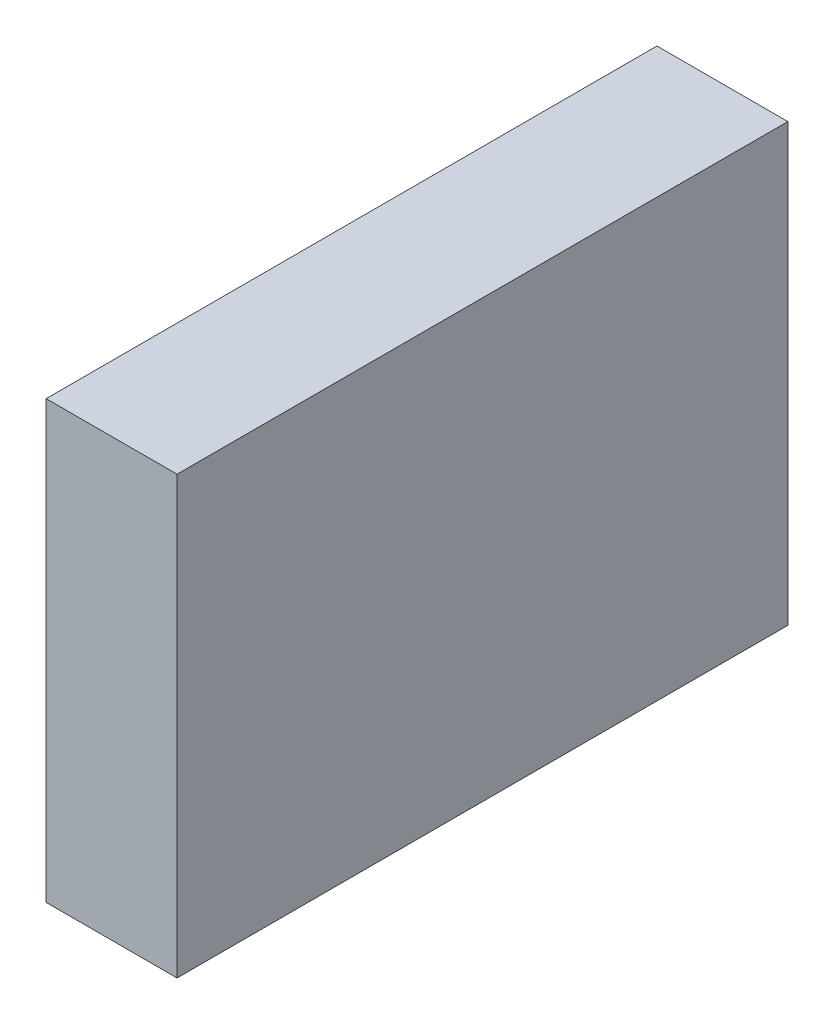
ISO-10303-21;
HEADER;
FILE_DESCRIPTION(('STEP AP214'),'2;1');
FILE_NAME('part.step','',(''),(''),'','','');
FILE_SCHEMA(('AUTOMOTIVE_DESIGN { 1 0 10303 214 1 1 1 1 }'));
ENDSEC;
DATA;
#1=APPLICATION_CONTEXT('core data for automotive mechanical design processes');
#2=APPLICATION_PROTOCOL_DEFINITION('international standard','automotive_design',2000,#1);
#3=PRODUCT_CONTEXT('',#1,'mechanical');
#4=PRODUCT('Part','Part','',(#3));
#5=PRODUCT_RELATED_PRODUCT_CATEGORY('part','',(#4));
#6=PRODUCT_DEFINITION_FORMATION('','',#4);
#7=PRODUCT_DEFINITION_CONTEXT('part definition',#1,'design');
#8=PRODUCT_DEFINITION('design','',#6,#7);
#9=PRODUCT_DEFINITION_SHAPE('','',#8);
#10=(LENGTH_UNIT() NAMED_UNIT(*) SI_UNIT(.MILLI.,.METRE.));
#11=(NAMED_UNIT(*) PLANE_ANGLE_UNIT() SI_UNIT($,.RADIAN.));
#12=(NAMED_UNIT(*) SI_UNIT($,.STERADIAN.) SOLID_ANGLE_UNIT());
#13=UNCERTAINTY_MEASURE_WITH_UNIT(LENGTH_MEASURE(1.E-05),#10,'distance_accuracy_value','');
#14=(GEOMETRIC_REPRESENTATION_CONTEXT(3) GLOBAL_UNCERTAINTY_ASSIGNED_CONTEXT((#13)) GLOBAL_UNIT_ASSIGNED_CONTEXT((#10,
#11,#12)) REPRESENTATION_CONTEXT('',''));
#15=CARTESIAN_POINT('',(0.,0.,0.));
#16=DIRECTION('',(0.,0.,1.));
#17=DIRECTION('',(1.,0.,0.));
#18=AXIS2_PLACEMENT_3D('',#15,#16,#17);
#19=CARTESIAN_POINT('',(2.99999968178111,-1.82000034706842,-3.72112136188662));
#20=DIRECTION('',(1.,-1.74845553146952E-07,0.));
#21=DIRECTION('',(1.74845553146952E-07,1.,-8.74227765734759E-08));
#22=AXIS2_PLACEMENT_3D('',#19,#20,#21);
#23=PLANE('',#22);
#24=DIRECTION('',(1.74845553146599E-07,0.999999999999981,-8.74227765732993E-08));
#25=VECTOR('',#24,1.);
#26=CARTESIAN_POINT('',(2.9999996940203,-1.75000034094883,-3.65112136800621));
#27=LINE('',#26,#25);
#28=CARTESIAN_POINT('',(2.9999996940203,-1.75000034094783,-3.65112136800621));
#29=VERTEX_POINT('',#28);
#30=CARTESIAN_POINT('',(2.99999986886585,-0.750000340946829,-3.65112145542799));
#31=VERTEX_POINT('',#30);
#32=EDGE_CURVE('E11',#29,#31,#27,.T.);
#33=ORIENTED_EDGE('',*,*,#32,.F.);
#34=DIRECTION('',(0.,-8.74227766369168E-08,-0.999999999999996));
#35=VECTOR('',#34,1.);
#36=CARTESIAN_POINT('',(2.99999969402031,-1.75000021855694,-2.25112136800621));
#37=LINE('',#36,#35);
#38=CARTESIAN_POINT('',(2.99999969402031,-1.75000021855694,-2.25112136800721));
#39=VERTEX_POINT('',#38);
#40=EDGE_CURVE('E59',#39,#29,#37,.T.);
#41=ORIENTED_EDGE('',*,*,#40,.F.);
#42=DIRECTION('',(-1.74845553146599E-07,-0.999999999999981,8.74227765732994E-08));
#43=VECTOR('',#42,1.);
#44=CARTESIAN_POINT('',(2.99999986886586,-0.750000218554941,-2.25112145542899));
#45=LINE('',#44,#43);
#46=CARTESIAN_POINT('',(2.99999986886586,-0.750000218555941,-2.25112145542899));
#47=VERTEX_POINT('',#46);
#48=EDGE_CURVE('E79',#47,#39,#45,.T.);
#49=ORIENTED_EDGE('',*,*,#48,.F.);
#50=DIRECTION('',(0.,8.74227765576152E-08,0.999999999999996));
#51=VECTOR('',#50,1.);
#52=CARTESIAN_POINT('',(2.99999986886585,-0.750000340946829,-3.65112145542899));
#53=LINE('',#52,#51);
#54=EDGE_CURVE('E84',#31,#47,#53,.T.);
#55=ORIENTED_EDGE('',*,*,#54,.F.);
#56=EDGE_LOOP('',(#33,#41,#49,#55));
#57=FACE_BOUND('',#56,.T.);
#58=ADVANCED_FACE('F17',(#57),#23,.F.);
#59=CARTESIAN_POINT('',(3.29999968178111,-1.82000039952209,-3.72112136188662));
#60=DIRECTION('',(1.,-1.74845553146952E-07,0.));
#61=DIRECTION('',(1.74845553146952E-07,1.,-8.74227765734759E-08));
#62=AXIS2_PLACEMENT_3D('',#59,#60,#61);
#63=PLANE('',#62);
#64=DIRECTION('',(0.,8.74227765576152E-08,0.999999999999996));
#65=VECTOR('',#64,1.);
#66=CARTESIAN_POINT('',(3.29999986886585,-0.750000393400494,-3.65112145542899));
#67=LINE('',#66,#65);
#68=CARTESIAN_POINT('',(3.29999986886585,-0.750000393400495,-3.65112145542799));
#69=VERTEX_POINT('',#68);
#70=CARTESIAN_POINT('',(3.29999986886586,-0.750000271009607,-2.25112145542899));
#71=VERTEX_POINT('',#70);
#72=EDGE_CURVE('E24',#69,#71,#67,.T.);
#73=ORIENTED_EDGE('',*,*,#72,.T.);
#74=DIRECTION('',(-1.74845553146599E-07,-0.999999999999981,8.74227765732994E-08));
#75=VECTOR('',#74,1.);
#76=CARTESIAN_POINT('',(3.29999986886586,-0.750000271008607,-2.25112145542899));
#77=LINE('',#76,#75);
#78=CARTESIAN_POINT('',(3.29999969402031,-1.75000027101061,-2.25112136800721));
#79=VERTEX_POINT('',#78);
#80=EDGE_CURVE('E82',#71,#79,#77,.T.);
#81=ORIENTED_EDGE('',*,*,#80,.T.);
#82=DIRECTION('',(0.,-8.74227764783136E-08,-0.999999999999996));
#83=VECTOR('',#82,1.);
#84=CARTESIAN_POINT('',(3.29999969402031,-1.75000027101061,-2.25112136800621));
#85=LINE('',#84,#83);
#86=CARTESIAN_POINT('',(3.2999996940203,-1.75000039340149,-3.65112136800621));
#87=VERTEX_POINT('',#86);
#88=EDGE_CURVE('E64',#79,#87,#85,.T.);
#89=ORIENTED_EDGE('',*,*,#88,.T.);
#90=DIRECTION('',(1.74845553146599E-07,0.999999999999981,-8.74227765732993E-08));
#91=VECTOR('',#90,1.);
#92=CARTESIAN_POINT('',(3.2999996940203,-1.75000039340249,-3.65112136800621));
#93=LINE('',#92,#91);
#94=EDGE_CURVE('E61',#87,#69,#93,.T.);
#95=ORIENTED_EDGE('',*,*,#94,.T.);
#96=EDGE_LOOP('',(#73,#81,#89,#95));
#97=FACE_BOUND('',#96,.T.);
#98=ADVANCED_FACE('F62',(#97),#63,.T.);
#99=CARTESIAN_POINT('',(2.99999986886585,-0.750000340946829,-3.65112145542899));
#100=DIRECTION('',(1.74845553146952E-07,1.,-8.74227765734759E-08));
#101=DIRECTION('',(0.,8.74227765734759E-08,1.));
#102=AXIS2_PLACEMENT_3D('',#99,#100,#101);
#103=PLANE('',#102);
#104=ORIENTED_EDGE('',*,*,#54,.T.);
#105=DIRECTION('',(0.999999999999985,-1.74845553220964E-07,0.));
#106=VECTOR('',#105,1.);
#107=CARTESIAN_POINT('',(2.99999986886586,-0.750000218554942,-2.25112145542899));
#108=LINE('',#107,#106);
#109=EDGE_CURVE('E57',#47,#71,#108,.T.);
#110=ORIENTED_EDGE('',*,*,#109,.T.);
#111=ORIENTED_EDGE('',*,*,#72,.F.);
#112=DIRECTION('',(0.999999999999985,-1.74845553220964E-07,0.));
#113=VECTOR('',#112,1.);
#114=CARTESIAN_POINT('',(2.99999986886585,-0.750000340946829,-3.65112145542899));
#115=LINE('',#114,#113);
#116=EDGE_CURVE('E55',#31,#69,#115,.T.);
#117=ORIENTED_EDGE('',*,*,#116,.F.);
#118=EDGE_LOOP('',(#104,#110,#111,#117));
#119=FACE_BOUND('',#118,.T.);
#120=ADVANCED_FACE('F53',(#119),#103,.T.);
#121=CARTESIAN_POINT('',(2.99999986886586,-0.750000218554942,-2.25112145542899));
#122=DIRECTION('',(0.,8.74227765734759E-08,1.));
#123=DIRECTION('',(-1.74845553146952E-07,-1.,8.74227765734759E-08));
#124=AXIS2_PLACEMENT_3D('',#121,#122,#123);
#125=PLANE('',#124);
#126=ORIENTED_EDGE('',*,*,#48,.T.);
#127=DIRECTION('',(0.999999999999985,-1.7484555285089E-07,0.));
#128=VECTOR('',#127,1.);
#129=CARTESIAN_POINT('',(2.99999969402031,-1.75000021855694,-2.25112136800621));
#130=LINE('',#129,#128);
#131=EDGE_CURVE('E68',#39,#79,#130,.T.);
#132=ORIENTED_EDGE('',*,*,#131,.T.);
#133=ORIENTED_EDGE('',*,*,#80,.F.);
#134=ORIENTED_EDGE('',*,*,#109,.F.);
#135=EDGE_LOOP('',(#126,#132,#133,#134));
#136=FACE_BOUND('',#135,.T.);
#137=ADVANCED_FACE('F91',(#136),#125,.T.);
#138=CARTESIAN_POINT('',(2.99999969402031,-1.75000021855694,-2.25112136800621));
#139=DIRECTION('',(-1.74845553146952E-07,-1.,8.74227765734759E-08));
#140=DIRECTION('',(0.,-8.74227765734759E-08,-1.));
#141=AXIS2_PLACEMENT_3D('',#138,#139,#140);
#142=PLANE('',#141);
#143=ORIENTED_EDGE('',*,*,#40,.T.);
#144=DIRECTION('',(0.999999999999985,-1.7484555285089E-07,0.));
#145=VECTOR('',#144,1.);
#146=CARTESIAN_POINT('',(2.9999996940203,-1.75000034094883,-3.65112136800621));
#147=LINE('',#146,#145);
#148=EDGE_CURVE('E69',#29,#87,#147,.T.);
#149=ORIENTED_EDGE('',*,*,#148,.T.);
#150=ORIENTED_EDGE('',*,*,#88,.F.);
#151=ORIENTED_EDGE('',*,*,#131,.F.);
#152=EDGE_LOOP('',(#143,#149,#150,#151));
#153=FACE_BOUND('',#152,.T.);
#154=ADVANCED_FACE('F88',(#153),#142,.T.);
#155=CARTESIAN_POINT('',(2.9999996940203,-1.75000034094883,-3.65112136800621));
#156=DIRECTION('',(0.,-8.74227765734759E-08,-1.));
#157=DIRECTION('',(1.74845553146952E-07,1.,-8.74227765734759E-08));
#158=AXIS2_PLACEMENT_3D('',#155,#156,#157);
#159=PLANE('',#158);
#160=ORIENTED_EDGE('',*,*,#32,.T.);
#161=ORIENTED_EDGE('',*,*,#116,.T.);
#162=ORIENTED_EDGE('',*,*,#94,.F.);
#163=ORIENTED_EDGE('',*,*,#148,.F.);
#164=EDGE_LOOP('',(#160,#161,#162,#163));
#165=FACE_BOUND('',#164,.T.);
#166=ADVANCED_FACE('F71',(#165),#159,.T.);
#167=CLOSED_SHELL('',(#58,#98,#120,#137,#154,#166));
#168=MANIFOLD_SOLID_BREP('B1',#167);
#169=ADVANCED_BREP_SHAPE_REPRESENTATION('',(#18,#168),#14);
#170=SHAPE_DEFINITION_REPRESENTATION(#9,#169);
ENDSEC;
END-ISO-10303-21;
